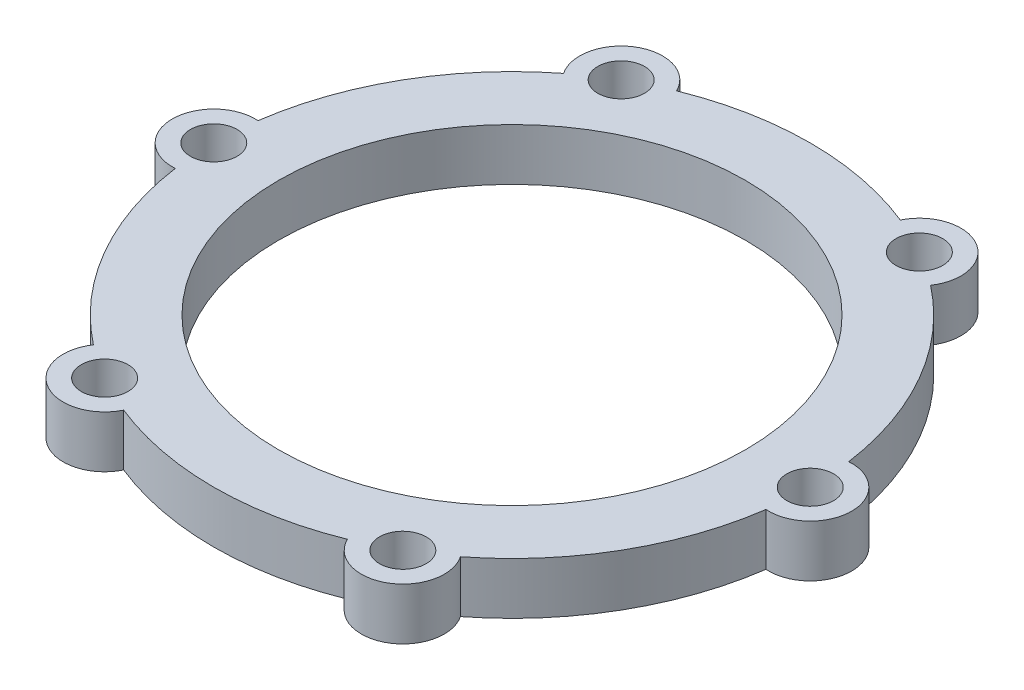
ISO-10303-21;
HEADER;
FILE_DESCRIPTION(('STEP AP214'),'2;1');
FILE_NAME('part.step','',(''),(''),'','','');
FILE_SCHEMA(('AUTOMOTIVE_DESIGN { 1 0 10303 214 1 1 1 1 }'));
ENDSEC;
DATA;
#1=APPLICATION_CONTEXT('core data for automotive mechanical design processes');
#2=APPLICATION_PROTOCOL_DEFINITION('international standard','automotive_design',2000,#1);
#3=PRODUCT_CONTEXT('',#1,'mechanical');
#4=PRODUCT('Part','Part','',(#3));
#5=PRODUCT_RELATED_PRODUCT_CATEGORY('part','',(#4));
#6=PRODUCT_DEFINITION_FORMATION('','',#4);
#7=PRODUCT_DEFINITION_CONTEXT('part definition',#1,'design');
#8=PRODUCT_DEFINITION('design','',#6,#7);
#9=PRODUCT_DEFINITION_SHAPE('','',#8);
#10=(LENGTH_UNIT() NAMED_UNIT(*) SI_UNIT(.MILLI.,.METRE.));
#11=(NAMED_UNIT(*) PLANE_ANGLE_UNIT() SI_UNIT($,.RADIAN.));
#12=(NAMED_UNIT(*) SI_UNIT($,.STERADIAN.) SOLID_ANGLE_UNIT());
#13=UNCERTAINTY_MEASURE_WITH_UNIT(LENGTH_MEASURE(1.E-05),#10,'distance_accuracy_value','');
#14=(GEOMETRIC_REPRESENTATION_CONTEXT(3) GLOBAL_UNCERTAINTY_ASSIGNED_CONTEXT((#13)) GLOBAL_UNIT_ASSIGNED_CONTEXT((#10,
#11,#12)) REPRESENTATION_CONTEXT('',''));
#15=CARTESIAN_POINT('',(0.,0.,0.));
#16=DIRECTION('',(0.,0.,1.));
#17=DIRECTION('',(1.,0.,0.));
#18=AXIS2_PLACEMENT_3D('',#15,#16,#17);
#19=CARTESIAN_POINT('',(0.,10.,0.));
#20=DIRECTION('',(0.,-1.,0.));
#21=DIRECTION('',(0.,0.,-1.));
#22=AXIS2_PLACEMENT_3D('',#19,#20,#21);
#23=CYLINDRICAL_SURFACE('',#22,57.5);
#24=CARTESIAN_POINT('',(0.,0.,0.));
#25=DIRECTION('',(0.,1.,0.));
#26=DIRECTION('',(0.,0.,1.));
#27=AXIS2_PLACEMENT_3D('',#24,#25,#26);
#28=CIRCLE('',#27,57.5);
#29=CARTESIAN_POINT('',(35.3831581356323,0.,45.3241891306269));
#30=VERTEX_POINT('',#29);
#31=CARTESIAN_POINT('',(56.9434782608696,0.,7.98061924626622));
#32=VERTEX_POINT('',#31);
#33=EDGE_CURVE('E200',#30,#32,#28,.T.);
#34=ORIENTED_EDGE('',*,*,#33,.T.);
#35=DIRECTION('',(0.,-1.,0.));
#36=VECTOR('',#35,1.);
#37=CARTESIAN_POINT('',(56.9434782608696,10.,7.98061924626622));
#38=LINE('',#37,#36);
#39=CARTESIAN_POINT('',(56.9434782608696,10.,7.98061924626622));
#40=VERTEX_POINT('',#39);
#41=EDGE_CURVE('E11',#40,#32,#38,.T.);
#42=ORIENTED_EDGE('',*,*,#41,.F.);
#43=CARTESIAN_POINT('',(0.,10.,0.));
#44=DIRECTION('',(0.,1.,0.));
#45=DIRECTION('',(0.,0.,1.));
#46=AXIS2_PLACEMENT_3D('',#43,#44,#45);
#47=CIRCLE('',#46,57.5);
#48=CARTESIAN_POINT('',(35.3831581356323,10.,45.3241891306269));
#49=VERTEX_POINT('',#48);
#50=EDGE_CURVE('E342',#49,#40,#47,.T.);
#51=ORIENTED_EDGE('',*,*,#50,.F.);
#52=DIRECTION('',(0.,-1.,0.));
#53=VECTOR('',#52,1.);
#54=CARTESIAN_POINT('',(35.3831581356323,10.,45.3241891306269));
#55=LINE('',#54,#53);
#56=EDGE_CURVE('E195',#49,#30,#55,.T.);
#57=ORIENTED_EDGE('',*,*,#56,.T.);
#58=EDGE_LOOP('',(#34,#42,#51,#57));
#59=FACE_BOUND('',#58,.T.);
#60=ADVANCED_FACE('F45',(#59),#23,.T.);
#61=CARTESIAN_POINT('',(57.5,10.,0.));
#62=DIRECTION('',(0.,-1.,0.));
#63=DIRECTION('',(0.,0.,-1.));
#64=AXIS2_PLACEMENT_3D('',#61,#62,#63);
#65=CYLINDRICAL_SURFACE('',#64,8.);
#66=CARTESIAN_POINT('',(57.5,0.,0.));
#67=DIRECTION('',(0.,1.,0.));
#68=DIRECTION('',(0.,0.,1.));
#69=AXIS2_PLACEMENT_3D('',#66,#67,#68);
#70=CIRCLE('',#69,8.);
#71=CARTESIAN_POINT('',(56.9434782608696,0.,-7.98061924626627));
#72=VERTEX_POINT('',#71);
#73=EDGE_CURVE('E204',#32,#72,#70,.T.);
#74=ORIENTED_EDGE('',*,*,#73,.T.);
#75=DIRECTION('',(0.,-1.,0.));
#76=VECTOR('',#75,1.);
#77=CARTESIAN_POINT('',(56.9434782608696,10.,-7.98061924626627));
#78=LINE('',#77,#76);
#79=CARTESIAN_POINT('',(56.9434782608696,10.,-7.98061924626627));
#80=VERTEX_POINT('',#79);
#81=EDGE_CURVE('E55',#80,#72,#78,.T.);
#82=ORIENTED_EDGE('',*,*,#81,.F.);
#83=CARTESIAN_POINT('',(57.5,10.,0.));
#84=DIRECTION('',(0.,1.,0.));
#85=DIRECTION('',(0.,0.,1.));
#86=AXIS2_PLACEMENT_3D('',#83,#84,#85);
#87=CIRCLE('',#86,8.);
#88=EDGE_CURVE('E118',#40,#80,#87,.T.);
#89=ORIENTED_EDGE('',*,*,#88,.F.);
#90=ORIENTED_EDGE('',*,*,#41,.T.);
#91=EDGE_LOOP('',(#74,#82,#89,#90));
#92=FACE_BOUND('',#91,.T.);
#93=ADVANCED_FACE('F358',(#92),#65,.T.);
#94=CARTESIAN_POINT('',(0.,10.,0.));
#95=DIRECTION('',(0.,-1.,0.));
#96=DIRECTION('',(0.,0.,-1.));
#97=AXIS2_PLACEMENT_3D('',#94,#95,#96);
#98=CYLINDRICAL_SURFACE('',#97,57.5);
#99=CARTESIAN_POINT('',(0.,0.,0.));
#100=DIRECTION('',(0.,1.,0.));
#101=DIRECTION('',(0.,0.,1.));
#102=AXIS2_PLACEMENT_3D('',#99,#100,#101);
#103=CIRCLE('',#102,57.5);
#104=CARTESIAN_POINT('',(35.3831581356323,0.,-45.3241891306269));
#105=VERTEX_POINT('',#104);
#106=EDGE_CURVE('E207',#72,#105,#103,.T.);
#107=ORIENTED_EDGE('',*,*,#106,.T.);
#108=DIRECTION('',(0.,-1.,0.));
#109=VECTOR('',#108,1.);
#110=CARTESIAN_POINT('',(35.3831581356323,10.,-45.3241891306269));
#111=LINE('',#110,#109);
#112=CARTESIAN_POINT('',(35.3831581356323,10.,-45.3241891306269));
#113=VERTEX_POINT('',#112);
#114=EDGE_CURVE('E285',#113,#105,#111,.T.);
#115=ORIENTED_EDGE('',*,*,#114,.F.);
#116=CARTESIAN_POINT('',(0.,10.,0.));
#117=DIRECTION('',(0.,1.,0.));
#118=DIRECTION('',(0.,0.,1.));
#119=AXIS2_PLACEMENT_3D('',#116,#117,#118);
#120=CIRCLE('',#119,57.5);
#121=EDGE_CURVE('E295',#80,#113,#120,.T.);
#122=ORIENTED_EDGE('',*,*,#121,.F.);
#123=ORIENTED_EDGE('',*,*,#81,.T.);
#124=EDGE_LOOP('',(#107,#115,#122,#123));
#125=FACE_BOUND('',#124,.T.);
#126=ADVANCED_FACE('F293',(#125),#98,.T.);
#127=CARTESIAN_POINT('',(28.7499999999999,10.,-49.7964607176053));
#128=DIRECTION('',(0.,-1.,0.));
#129=DIRECTION('',(0.,0.,-1.));
#130=AXIS2_PLACEMENT_3D('',#127,#128,#129);
#131=CYLINDRICAL_SURFACE('',#130,8.);
#132=CARTESIAN_POINT('',(28.7499999999999,0.,-49.7964607176053));
#133=DIRECTION('',(0.,1.,0.));
#134=DIRECTION('',(0.,0.,1.));
#135=AXIS2_PLACEMENT_3D('',#132,#133,#134);
#136=CIRCLE('',#135,8.);
#137=CARTESIAN_POINT('',(21.5603201252371,0.,-53.3048083768931));
#138=VERTEX_POINT('',#137);
#139=EDGE_CURVE('E210',#105,#138,#136,.T.);
#140=ORIENTED_EDGE('',*,*,#139,.T.);
#141=DIRECTION('',(0.,-1.,0.));
#142=VECTOR('',#141,1.);
#143=CARTESIAN_POINT('',(21.5603201252371,10.,-53.3048083768931));
#144=LINE('',#143,#142);
#145=CARTESIAN_POINT('',(21.5603201252371,10.,-53.3048083768931));
#146=VERTEX_POINT('',#145);
#147=EDGE_CURVE('E281',#146,#138,#144,.T.);
#148=ORIENTED_EDGE('',*,*,#147,.F.);
#149=CARTESIAN_POINT('',(28.7499999999999,10.,-49.7964607176053));
#150=DIRECTION('',(0.,1.,0.));
#151=DIRECTION('',(0.,0.,1.));
#152=AXIS2_PLACEMENT_3D('',#149,#150,#151);
#153=CIRCLE('',#152,8.);
#154=EDGE_CURVE('E315',#113,#146,#153,.T.);
#155=ORIENTED_EDGE('',*,*,#154,.F.);
#156=ORIENTED_EDGE('',*,*,#114,.T.);
#157=EDGE_LOOP('',(#140,#148,#155,#156));
#158=FACE_BOUND('',#157,.T.);
#159=ADVANCED_FACE('F305',(#158),#131,.T.);
#160=CARTESIAN_POINT('',(0.,10.,0.));
#161=DIRECTION('',(0.,-1.,0.));
#162=DIRECTION('',(0.,0.,-1.));
#163=AXIS2_PLACEMENT_3D('',#160,#161,#162);
#164=CYLINDRICAL_SURFACE('',#163,57.5);
#165=CARTESIAN_POINT('',(0.,0.,0.));
#166=DIRECTION('',(0.,1.,0.));
#167=DIRECTION('',(0.,0.,1.));
#168=AXIS2_PLACEMENT_3D('',#165,#166,#167);
#169=CIRCLE('',#168,57.5);
#170=CARTESIAN_POINT('',(-21.5603201252367,0.,-53.3048083768933));
#171=VERTEX_POINT('',#170);
#172=EDGE_CURVE('E213',#138,#171,#169,.T.);
#173=ORIENTED_EDGE('',*,*,#172,.T.);
#174=DIRECTION('',(0.,-1.,0.));
#175=VECTOR('',#174,1.);
#176=CARTESIAN_POINT('',(-21.5603201252367,10.,-53.3048083768933));
#177=LINE('',#176,#175);
#178=CARTESIAN_POINT('',(-21.5603201252367,10.,-53.3048083768933));
#179=VERTEX_POINT('',#178);
#180=EDGE_CURVE('E277',#179,#171,#177,.T.);
#181=ORIENTED_EDGE('',*,*,#180,.F.);
#182=CARTESIAN_POINT('',(0.,10.,0.));
#183=DIRECTION('',(0.,1.,0.));
#184=DIRECTION('',(0.,0.,1.));
#185=AXIS2_PLACEMENT_3D('',#182,#183,#184);
#186=CIRCLE('',#185,57.5);
#187=EDGE_CURVE('E311',#146,#179,#186,.T.);
#188=ORIENTED_EDGE('',*,*,#187,.F.);
#189=ORIENTED_EDGE('',*,*,#147,.T.);
#190=EDGE_LOOP('',(#173,#181,#188,#189));
#191=FACE_BOUND('',#190,.T.);
#192=ADVANCED_FACE('F309',(#191),#164,.T.);
#193=CARTESIAN_POINT('',(-28.7499999999996,10.,-49.7964607176055));
#194=DIRECTION('',(0.,-1.,0.));
#195=DIRECTION('',(0.,0.,-1.));
#196=AXIS2_PLACEMENT_3D('',#193,#194,#195);
#197=CYLINDRICAL_SURFACE('',#196,8.);
#198=CARTESIAN_POINT('',(-28.7499999999996,0.,-49.7964607176055));
#199=DIRECTION('',(0.,1.,0.));
#200=DIRECTION('',(0.,0.,1.));
#201=AXIS2_PLACEMENT_3D('',#198,#199,#200);
#202=CIRCLE('',#201,8.);
#203=CARTESIAN_POINT('',(-35.383158135632,0.,-45.3241891306272));
#204=VERTEX_POINT('',#203);
#205=EDGE_CURVE('E216',#171,#204,#202,.T.);
#206=ORIENTED_EDGE('',*,*,#205,.T.);
#207=DIRECTION('',(0.,-1.,0.));
#208=VECTOR('',#207,1.);
#209=CARTESIAN_POINT('',(-35.383158135632,10.,-45.3241891306272));
#210=LINE('',#209,#208);
#211=CARTESIAN_POINT('',(-35.383158135632,10.,-45.3241891306272));
#212=VERTEX_POINT('',#211);
#213=EDGE_CURVE('E273',#212,#204,#210,.T.);
#214=ORIENTED_EDGE('',*,*,#213,.F.);
#215=CARTESIAN_POINT('',(-28.7499999999996,10.,-49.7964607176055));
#216=DIRECTION('',(0.,1.,0.));
#217=DIRECTION('',(0.,0.,1.));
#218=AXIS2_PLACEMENT_3D('',#215,#216,#217);
#219=CIRCLE('',#218,8.);
#220=EDGE_CURVE('E314',#179,#212,#219,.T.);
#221=ORIENTED_EDGE('',*,*,#220,.F.);
#222=ORIENTED_EDGE('',*,*,#180,.T.);
#223=EDGE_LOOP('',(#206,#214,#221,#222));
#224=FACE_BOUND('',#223,.T.);
#225=ADVANCED_FACE('F370',(#224),#197,.T.);
#226=CARTESIAN_POINT('',(0.,10.,0.));
#227=DIRECTION('',(0.,-1.,0.));
#228=DIRECTION('',(0.,0.,-1.));
#229=AXIS2_PLACEMENT_3D('',#226,#227,#228);
#230=CYLINDRICAL_SURFACE('',#229,57.5);
#231=CARTESIAN_POINT('',(0.,0.,0.));
#232=DIRECTION('',(0.,1.,0.));
#233=DIRECTION('',(0.,0.,1.));
#234=AXIS2_PLACEMENT_3D('',#231,#232,#233);
#235=CIRCLE('',#234,57.5);
#236=CARTESIAN_POINT('',(-56.9434782608695,0.,-7.98061924626663));
#237=VERTEX_POINT('',#236);
#238=EDGE_CURVE('E219',#204,#237,#235,.T.);
#239=ORIENTED_EDGE('',*,*,#238,.T.);
#240=DIRECTION('',(0.,-1.,0.));
#241=VECTOR('',#240,1.);
#242=CARTESIAN_POINT('',(-56.9434782608695,10.,-7.98061924626663));
#243=LINE('',#242,#241);
#244=CARTESIAN_POINT('',(-56.9434782608695,10.,-7.98061924626663));
#245=VERTEX_POINT('',#244);
#246=EDGE_CURVE('E269',#245,#237,#243,.T.);
#247=ORIENTED_EDGE('',*,*,#246,.F.);
#248=CARTESIAN_POINT('',(0.,10.,0.));
#249=DIRECTION('',(0.,1.,0.));
#250=DIRECTION('',(0.,0.,1.));
#251=AXIS2_PLACEMENT_3D('',#248,#249,#250);
#252=CIRCLE('',#251,57.5);
#253=EDGE_CURVE('E319',#212,#245,#252,.T.);
#254=ORIENTED_EDGE('',*,*,#253,.F.);
#255=ORIENTED_EDGE('',*,*,#213,.T.);
#256=EDGE_LOOP('',(#239,#247,#254,#255));
#257=FACE_BOUND('',#256,.T.);
#258=ADVANCED_FACE('F373',(#257),#230,.T.);
#259=CARTESIAN_POINT('',(-57.5,10.,-3.92047505570758E-13));
#260=DIRECTION('',(0.,-1.,0.));
#261=DIRECTION('',(0.,0.,-1.));
#262=AXIS2_PLACEMENT_3D('',#259,#260,#261);
#263=CYLINDRICAL_SURFACE('',#262,8.);
#264=CARTESIAN_POINT('',(-57.5,0.,-3.92047505570758E-13));
#265=DIRECTION('',(0.,1.,0.));
#266=DIRECTION('',(0.,0.,1.));
#267=AXIS2_PLACEMENT_3D('',#264,#265,#266);
#268=CIRCLE('',#267,8.);
#269=CARTESIAN_POINT('',(-56.9434782608696,0.,7.98061924626585));
#270=VERTEX_POINT('',#269);
#271=EDGE_CURVE('E222',#237,#270,#268,.T.);
#272=ORIENTED_EDGE('',*,*,#271,.T.);
#273=DIRECTION('',(0.,-1.,0.));
#274=VECTOR('',#273,1.);
#275=CARTESIAN_POINT('',(-56.9434782608696,10.,7.98061924626585));
#276=LINE('',#275,#274);
#277=CARTESIAN_POINT('',(-56.9434782608696,10.,7.98061924626585));
#278=VERTEX_POINT('',#277);
#279=EDGE_CURVE('E265',#278,#270,#276,.T.);
#280=ORIENTED_EDGE('',*,*,#279,.F.);
#281=CARTESIAN_POINT('',(-57.5,10.,-3.92047505570758E-13));
#282=DIRECTION('',(0.,1.,0.));
#283=DIRECTION('',(0.,0.,1.));
#284=AXIS2_PLACEMENT_3D('',#281,#282,#283);
#285=CIRCLE('',#284,8.);
#286=EDGE_CURVE('E326',#245,#278,#285,.T.);
#287=ORIENTED_EDGE('',*,*,#286,.F.);
#288=ORIENTED_EDGE('',*,*,#246,.T.);
#289=EDGE_LOOP('',(#272,#280,#287,#288));
#290=FACE_BOUND('',#289,.T.);
#291=ADVANCED_FACE('F334',(#290),#263,.T.);
#292=CARTESIAN_POINT('',(0.,10.,0.));
#293=DIRECTION('',(0.,-1.,0.));
#294=DIRECTION('',(0.,0.,-1.));
#295=AXIS2_PLACEMENT_3D('',#292,#293,#294);
#296=CYLINDRICAL_SURFACE('',#295,57.5);
#297=CARTESIAN_POINT('',(0.,0.,0.));
#298=DIRECTION('',(0.,1.,0.));
#299=DIRECTION('',(0.,0.,1.));
#300=AXIS2_PLACEMENT_3D('',#297,#298,#299);
#301=CIRCLE('',#300,57.5);
#302=CARTESIAN_POINT('',(-35.3831581356326,0.,45.3241891306267));
#303=VERTEX_POINT('',#302);
#304=EDGE_CURVE('E225',#270,#303,#301,.T.);
#305=ORIENTED_EDGE('',*,*,#304,.T.);
#306=DIRECTION('',(0.,-1.,0.));
#307=VECTOR('',#306,1.);
#308=CARTESIAN_POINT('',(-35.3831581356326,10.,45.3241891306267));
#309=LINE('',#308,#307);
#310=CARTESIAN_POINT('',(-35.3831581356326,10.,45.3241891306267));
#311=VERTEX_POINT('',#310);
#312=EDGE_CURVE('E161',#311,#303,#309,.T.);
#313=ORIENTED_EDGE('',*,*,#312,.F.);
#314=CARTESIAN_POINT('',(0.,10.,0.));
#315=DIRECTION('',(0.,1.,0.));
#316=DIRECTION('',(0.,0.,1.));
#317=AXIS2_PLACEMENT_3D('',#314,#315,#316);
#318=CIRCLE('',#317,57.5);
#319=EDGE_CURVE('E150',#278,#311,#318,.T.);
#320=ORIENTED_EDGE('',*,*,#319,.F.);
#321=ORIENTED_EDGE('',*,*,#279,.T.);
#322=EDGE_LOOP('',(#305,#313,#320,#321));
#323=FACE_BOUND('',#322,.T.);
#324=ADVANCED_FACE('F338',(#323),#296,.T.);
#325=CARTESIAN_POINT('',(-28.7500000000002,10.,49.7964607176051));
#326=DIRECTION('',(0.,-1.,0.));
#327=DIRECTION('',(0.,0.,-1.));
#328=AXIS2_PLACEMENT_3D('',#325,#326,#327);
#329=CYLINDRICAL_SURFACE('',#328,7.99999999999999);
#330=CARTESIAN_POINT('',(-28.7500000000002,0.,49.7964607176051));
#331=DIRECTION('',(0.,1.,0.));
#332=DIRECTION('',(0.,0.,1.));
#333=AXIS2_PLACEMENT_3D('',#330,#331,#332);
#334=CIRCLE('',#333,7.99999999999999);
#335=CARTESIAN_POINT('',(-21.5603201252374,0.,53.304808376893));
#336=VERTEX_POINT('',#335);
#337=EDGE_CURVE('E159',#303,#336,#334,.T.);
#338=ORIENTED_EDGE('',*,*,#337,.T.);
#339=DIRECTION('',(0.,-1.,0.));
#340=VECTOR('',#339,1.);
#341=CARTESIAN_POINT('',(-21.5603201252374,10.,53.304808376893));
#342=LINE('',#341,#340);
#343=CARTESIAN_POINT('',(-21.5603201252374,10.,53.304808376893));
#344=VERTEX_POINT('',#343);
#345=EDGE_CURVE('E156',#344,#336,#342,.T.);
#346=ORIENTED_EDGE('',*,*,#345,.F.);
#347=CARTESIAN_POINT('',(-28.7500000000002,10.,49.7964607176051));
#348=DIRECTION('',(0.,1.,0.));
#349=DIRECTION('',(0.,0.,1.));
#350=AXIS2_PLACEMENT_3D('',#347,#348,#349);
#351=CIRCLE('',#350,7.99999999999999);
#352=EDGE_CURVE('E143',#311,#344,#351,.T.);
#353=ORIENTED_EDGE('',*,*,#352,.F.);
#354=ORIENTED_EDGE('',*,*,#312,.T.);
#355=EDGE_LOOP('',(#338,#346,#353,#354));
#356=FACE_BOUND('',#355,.T.);
#357=ADVANCED_FACE('F157',(#356),#329,.T.);
#358=CARTESIAN_POINT('',(0.,10.,0.));
#359=DIRECTION('',(0.,-1.,0.));
#360=DIRECTION('',(0.,0.,-1.));
#361=AXIS2_PLACEMENT_3D('',#358,#359,#360);
#362=CYLINDRICAL_SURFACE('',#361,57.5);
#363=CARTESIAN_POINT('',(0.,0.,0.));
#364=DIRECTION('',(0.,1.,0.));
#365=DIRECTION('',(0.,0.,1.));
#366=AXIS2_PLACEMENT_3D('',#363,#364,#365);
#367=CIRCLE('',#366,57.5);
#368=CARTESIAN_POINT('',(21.5603201252371,0.,53.3048083768931));
#369=VERTEX_POINT('',#368);
#370=EDGE_CURVE('E104',#336,#369,#367,.T.);
#371=ORIENTED_EDGE('',*,*,#370,.T.);
#372=DIRECTION('',(0.,-1.,0.));
#373=VECTOR('',#372,1.);
#374=CARTESIAN_POINT('',(21.5603201252371,10.,53.3048083768931));
#375=LINE('',#374,#373);
#376=CARTESIAN_POINT('',(21.5603201252371,10.,53.3048083768931));
#377=VERTEX_POINT('',#376);
#378=EDGE_CURVE('E162',#377,#369,#375,.T.);
#379=ORIENTED_EDGE('',*,*,#378,.F.);
#380=CARTESIAN_POINT('',(0.,10.,0.));
#381=DIRECTION('',(0.,1.,0.));
#382=DIRECTION('',(0.,0.,1.));
#383=AXIS2_PLACEMENT_3D('',#380,#381,#382);
#384=CIRCLE('',#383,57.5);
#385=EDGE_CURVE('E148',#344,#377,#384,.T.);
#386=ORIENTED_EDGE('',*,*,#385,.F.);
#387=ORIENTED_EDGE('',*,*,#345,.T.);
#388=EDGE_LOOP('',(#371,#379,#386,#387));
#389=FACE_BOUND('',#388,.T.);
#390=ADVANCED_FACE('F164',(#389),#362,.T.);
#391=CARTESIAN_POINT('',(28.7499999999999,10.,-49.7964607176053));
#392=DIRECTION('',(0.,-1.,0.));
#393=DIRECTION('',(0.,0.,-1.));
#394=AXIS2_PLACEMENT_3D('',#391,#392,#393);
#395=CYLINDRICAL_SURFACE('',#394,4.5);
#396=CARTESIAN_POINT('',(28.7499999999999,10.,-49.7964607176053));
#397=DIRECTION('',(0.,1.,0.));
#398=DIRECTION('',(0.,0.,1.));
#399=AXIS2_PLACEMENT_3D('',#396,#397,#398);
#400=CIRCLE('',#399,4.5);
#401=CARTESIAN_POINT('',(28.7499999999999,10.,-45.2964607176053));
#402=VERTEX_POINT('',#401);
#403=EDGE_CURVE('E187',#402,#402,#400,.T.);
#404=ORIENTED_EDGE('',*,*,#403,.T.);
#405=EDGE_LOOP('',(#404));
#406=FACE_BOUND('',#405,.T.);
#407=CARTESIAN_POINT('',(28.7499999999999,0.,-49.7964607176053));
#408=DIRECTION('',(0.,1.,0.));
#409=DIRECTION('',(0.,0.,1.));
#410=AXIS2_PLACEMENT_3D('',#407,#408,#409);
#411=CIRCLE('',#410,4.5);
#412=CARTESIAN_POINT('',(28.7499999999999,0.,-45.2964607176053));
#413=VERTEX_POINT('',#412);
#414=EDGE_CURVE('E250',#413,#413,#411,.T.);
#415=ORIENTED_EDGE('',*,*,#414,.F.);
#416=EDGE_LOOP('',(#415));
#417=FACE_BOUND('',#416,.T.);
#418=ADVANCED_FACE('F384',(#406,#417),#395,.F.);
#419=CARTESIAN_POINT('',(-28.7499999999996,10.,-49.7964607176055));
#420=DIRECTION('',(0.,-1.,0.));
#421=DIRECTION('',(0.,0.,-1.));
#422=AXIS2_PLACEMENT_3D('',#419,#420,#421);
#423=CYLINDRICAL_SURFACE('',#422,4.5);
#424=CARTESIAN_POINT('',(-28.7499999999996,10.,-49.7964607176055));
#425=DIRECTION('',(0.,1.,0.));
#426=DIRECTION('',(0.,0.,1.));
#427=AXIS2_PLACEMENT_3D('',#424,#425,#426);
#428=CIRCLE('',#427,4.5);
#429=CARTESIAN_POINT('',(-28.7499999999996,10.,-45.2964607176055));
#430=VERTEX_POINT('',#429);
#431=EDGE_CURVE('E183',#430,#430,#428,.T.);
#432=ORIENTED_EDGE('',*,*,#431,.T.);
#433=EDGE_LOOP('',(#432));
#434=FACE_BOUND('',#433,.T.);
#435=CARTESIAN_POINT('',(-28.7499999999996,0.,-49.7964607176055));
#436=DIRECTION('',(0.,1.,0.));
#437=DIRECTION('',(0.,0.,1.));
#438=AXIS2_PLACEMENT_3D('',#435,#436,#437);
#439=CIRCLE('',#438,4.5);
#440=CARTESIAN_POINT('',(-28.7499999999996,0.,-45.2964607176055));
#441=VERTEX_POINT('',#440);
#442=EDGE_CURVE('E246',#441,#441,#439,.T.);
#443=ORIENTED_EDGE('',*,*,#442,.F.);
#444=EDGE_LOOP('',(#443));
#445=FACE_BOUND('',#444,.T.);
#446=ADVANCED_FACE('F388',(#434,#445),#423,.F.);
#447=CARTESIAN_POINT('',(-57.5,10.,-3.92047505570758E-13));
#448=DIRECTION('',(0.,-1.,0.));
#449=DIRECTION('',(0.,0.,-1.));
#450=AXIS2_PLACEMENT_3D('',#447,#448,#449);
#451=CYLINDRICAL_SURFACE('',#450,4.49999999999999);
#452=CARTESIAN_POINT('',(-57.5,10.,-3.92047505570758E-13));
#453=DIRECTION('',(0.,1.,0.));
#454=DIRECTION('',(0.,0.,1.));
#455=AXIS2_PLACEMENT_3D('',#452,#453,#454);
#456=CIRCLE('',#455,4.49999999999999);
#457=CARTESIAN_POINT('',(-57.5,10.,4.4999999999996));
#458=VERTEX_POINT('',#457);
#459=EDGE_CURVE('E179',#458,#458,#456,.T.);
#460=ORIENTED_EDGE('',*,*,#459,.T.);
#461=EDGE_LOOP('',(#460));
#462=FACE_BOUND('',#461,.T.);
#463=CARTESIAN_POINT('',(-57.5,0.,-3.92047505570758E-13));
#464=DIRECTION('',(0.,1.,0.));
#465=DIRECTION('',(0.,0.,1.));
#466=AXIS2_PLACEMENT_3D('',#463,#464,#465);
#467=CIRCLE('',#466,4.49999999999999);
#468=CARTESIAN_POINT('',(-57.5,0.,4.4999999999996));
#469=VERTEX_POINT('',#468);
#470=EDGE_CURVE('E242',#469,#469,#467,.T.);
#471=ORIENTED_EDGE('',*,*,#470,.F.);
#472=EDGE_LOOP('',(#471));
#473=FACE_BOUND('',#472,.T.);
#474=ADVANCED_FACE('F394',(#462,#473),#451,.F.);
#475=CARTESIAN_POINT('',(-28.7500000000002,10.,49.7964607176051));
#476=DIRECTION('',(0.,-1.,0.));
#477=DIRECTION('',(0.,0.,-1.));
#478=AXIS2_PLACEMENT_3D('',#475,#476,#477);
#479=CYLINDRICAL_SURFACE('',#478,4.5);
#480=CARTESIAN_POINT('',(-28.7500000000002,10.,49.7964607176051));
#481=DIRECTION('',(0.,1.,0.));
#482=DIRECTION('',(0.,0.,1.));
#483=AXIS2_PLACEMENT_3D('',#480,#481,#482);
#484=CIRCLE('',#483,4.5);
#485=CARTESIAN_POINT('',(-28.7500000000002,10.,54.2964607176051));
#486=VERTEX_POINT('',#485);
#487=EDGE_CURVE('E175',#486,#486,#484,.T.);
#488=ORIENTED_EDGE('',*,*,#487,.T.);
#489=EDGE_LOOP('',(#488));
#490=FACE_BOUND('',#489,.T.);
#491=CARTESIAN_POINT('',(-28.7500000000002,0.,49.7964607176051));
#492=DIRECTION('',(0.,1.,0.));
#493=DIRECTION('',(0.,0.,1.));
#494=AXIS2_PLACEMENT_3D('',#491,#492,#493);
#495=CIRCLE('',#494,4.5);
#496=CARTESIAN_POINT('',(-28.7500000000002,0.,54.2964607176051));
#497=VERTEX_POINT('',#496);
#498=EDGE_CURVE('E238',#497,#497,#495,.T.);
#499=ORIENTED_EDGE('',*,*,#498,.F.);
#500=EDGE_LOOP('',(#499));
#501=FACE_BOUND('',#500,.T.);
#502=ADVANCED_FACE('F353',(#490,#501),#479,.F.);
#503=CARTESIAN_POINT('',(28.7499999999999,10.,49.7964607176053));
#504=DIRECTION('',(0.,-1.,0.));
#505=DIRECTION('',(0.,0.,-1.));
#506=AXIS2_PLACEMENT_3D('',#503,#504,#505);
#507=CYLINDRICAL_SURFACE('',#506,4.5);
#508=CARTESIAN_POINT('',(28.7499999999999,10.,49.7964607176053));
#509=DIRECTION('',(0.,1.,0.));
#510=DIRECTION('',(0.,0.,1.));
#511=AXIS2_PLACEMENT_3D('',#508,#509,#510);
#512=CIRCLE('',#511,4.5);
#513=CARTESIAN_POINT('',(28.7499999999999,10.,54.2964607176053));
#514=VERTEX_POINT('',#513);
#515=EDGE_CURVE('E168',#514,#514,#512,.T.);
#516=ORIENTED_EDGE('',*,*,#515,.T.);
#517=EDGE_LOOP('',(#516));
#518=FACE_BOUND('',#517,.T.);
#519=CARTESIAN_POINT('',(28.7499999999999,0.,49.7964607176053));
#520=DIRECTION('',(0.,1.,0.));
#521=DIRECTION('',(0.,0.,1.));
#522=AXIS2_PLACEMENT_3D('',#519,#520,#521);
#523=CIRCLE('',#522,4.5);
#524=CARTESIAN_POINT('',(28.7499999999999,0.,54.2964607176053));
#525=VERTEX_POINT('',#524);
#526=EDGE_CURVE('E234',#525,#525,#523,.T.);
#527=ORIENTED_EDGE('',*,*,#526,.F.);
#528=EDGE_LOOP('',(#527));
#529=FACE_BOUND('',#528,.T.);
#530=ADVANCED_FACE('F345',(#518,#529),#507,.F.);
#531=CARTESIAN_POINT('',(28.7499999999999,10.,49.7964607176053));
#532=DIRECTION('',(0.,-1.,0.));
#533=DIRECTION('',(0.,0.,-1.));
#534=AXIS2_PLACEMENT_3D('',#531,#532,#533);
#535=CYLINDRICAL_SURFACE('',#534,8.);
#536=CARTESIAN_POINT('',(28.7499999999999,0.,49.7964607176053));
#537=DIRECTION('',(0.,1.,0.));
#538=DIRECTION('',(0.,0.,1.));
#539=AXIS2_PLACEMENT_3D('',#536,#537,#538);
#540=CIRCLE('',#539,8.);
#541=EDGE_CURVE('E110',#369,#30,#540,.T.);
#542=ORIENTED_EDGE('',*,*,#541,.T.);
#543=ORIENTED_EDGE('',*,*,#56,.F.);
#544=CARTESIAN_POINT('',(28.7499999999999,10.,49.7964607176053));
#545=DIRECTION('',(0.,1.,0.));
#546=DIRECTION('',(0.,0.,1.));
#547=AXIS2_PLACEMENT_3D('',#544,#545,#546);
#548=CIRCLE('',#547,8.);
#549=EDGE_CURVE('E63',#377,#49,#548,.T.);
#550=ORIENTED_EDGE('',*,*,#549,.F.);
#551=ORIENTED_EDGE('',*,*,#378,.T.);
#552=EDGE_LOOP('',(#542,#543,#550,#551));
#553=FACE_BOUND('',#552,.T.);
#554=ADVANCED_FACE('F343',(#553),#535,.T.);
#555=CARTESIAN_POINT('',(0.,10.,0.));
#556=DIRECTION('',(0.,-1.,0.));
#557=DIRECTION('',(0.,0.,-1.));
#558=AXIS2_PLACEMENT_3D('',#555,#556,#557);
#559=CYLINDRICAL_SURFACE('',#558,45.);
#560=CARTESIAN_POINT('',(0.,10.,0.));
#561=DIRECTION('',(0.,1.,0.));
#562=DIRECTION('',(0.,0.,1.));
#563=AXIS2_PLACEMENT_3D('',#560,#561,#562);
#564=CIRCLE('',#563,45.);
#565=CARTESIAN_POINT('',(0.,10.,45.));
#566=VERTEX_POINT('',#565);
#567=EDGE_CURVE('E258',#566,#566,#564,.T.);
#568=ORIENTED_EDGE('',*,*,#567,.T.);
#569=EDGE_LOOP('',(#568));
#570=FACE_BOUND('',#569,.T.);
#571=CARTESIAN_POINT('',(0.,0.,0.));
#572=DIRECTION('',(0.,1.,0.));
#573=DIRECTION('',(0.,0.,1.));
#574=AXIS2_PLACEMENT_3D('',#571,#572,#573);
#575=CIRCLE('',#574,45.);
#576=CARTESIAN_POINT('',(0.,0.,45.));
#577=VERTEX_POINT('',#576);
#578=EDGE_CURVE('E196',#577,#577,#575,.T.);
#579=ORIENTED_EDGE('',*,*,#578,.F.);
#580=EDGE_LOOP('',(#579));
#581=FACE_BOUND('',#580,.T.);
#582=ADVANCED_FACE('F47',(#570,#581),#559,.F.);
#583=CARTESIAN_POINT('',(57.5,10.,0.));
#584=DIRECTION('',(0.,-1.,0.));
#585=DIRECTION('',(0.,0.,-1.));
#586=AXIS2_PLACEMENT_3D('',#583,#584,#585);
#587=CYLINDRICAL_SURFACE('',#586,4.49999999999999);
#588=CARTESIAN_POINT('',(57.5,10.,0.));
#589=DIRECTION('',(0.,1.,0.));
#590=DIRECTION('',(0.,0.,1.));
#591=AXIS2_PLACEMENT_3D('',#588,#589,#590);
#592=CIRCLE('',#591,4.49999999999999);
#593=CARTESIAN_POINT('',(57.5,10.,4.49999999999996));
#594=VERTEX_POINT('',#593);
#595=EDGE_CURVE('E191',#594,#594,#592,.T.);
#596=ORIENTED_EDGE('',*,*,#595,.T.);
#597=EDGE_LOOP('',(#596));
#598=FACE_BOUND('',#597,.T.);
#599=CARTESIAN_POINT('',(57.5,0.,0.));
#600=DIRECTION('',(0.,1.,0.));
#601=DIRECTION('',(0.,0.,1.));
#602=AXIS2_PLACEMENT_3D('',#599,#600,#601);
#603=CIRCLE('',#602,4.49999999999999);
#604=CARTESIAN_POINT('',(57.5,0.,4.49999999999996));
#605=VERTEX_POINT('',#604);
#606=EDGE_CURVE('E254',#605,#605,#603,.T.);
#607=ORIENTED_EDGE('',*,*,#606,.F.);
#608=EDGE_LOOP('',(#607));
#609=FACE_BOUND('',#608,.T.);
#610=ADVANCED_FACE('F351',(#598,#609),#587,.F.);
#611=CARTESIAN_POINT('',(0.,10.,0.));
#612=DIRECTION('',(0.,1.,0.));
#613=DIRECTION('',(0.,0.,1.));
#614=AXIS2_PLACEMENT_3D('',#611,#612,#613);
#615=PLANE('',#614);
#616=ORIENTED_EDGE('',*,*,#567,.F.);
#617=EDGE_LOOP('',(#616));
#618=FACE_BOUND('',#617,.T.);
#619=ORIENTED_EDGE('',*,*,#50,.T.);
#620=ORIENTED_EDGE('',*,*,#88,.T.);
#621=ORIENTED_EDGE('',*,*,#121,.T.);
#622=ORIENTED_EDGE('',*,*,#154,.T.);
#623=ORIENTED_EDGE('',*,*,#187,.T.);
#624=ORIENTED_EDGE('',*,*,#220,.T.);
#625=ORIENTED_EDGE('',*,*,#253,.T.);
#626=ORIENTED_EDGE('',*,*,#286,.T.);
#627=ORIENTED_EDGE('',*,*,#319,.T.);
#628=ORIENTED_EDGE('',*,*,#352,.T.);
#629=ORIENTED_EDGE('',*,*,#385,.T.);
#630=ORIENTED_EDGE('',*,*,#549,.T.);
#631=EDGE_LOOP('',(#619,#620,#621,#622,#623,#624,#625,#626,#627,#628,#629,#630));
#632=FACE_BOUND('',#631,.T.);
#633=ORIENTED_EDGE('',*,*,#515,.F.);
#634=EDGE_LOOP('',(#633));
#635=FACE_BOUND('',#634,.T.);
#636=ORIENTED_EDGE('',*,*,#487,.F.);
#637=EDGE_LOOP('',(#636));
#638=FACE_BOUND('',#637,.T.);
#639=ORIENTED_EDGE('',*,*,#459,.F.);
#640=EDGE_LOOP('',(#639));
#641=FACE_BOUND('',#640,.T.);
#642=ORIENTED_EDGE('',*,*,#431,.F.);
#643=EDGE_LOOP('',(#642));
#644=FACE_BOUND('',#643,.T.);
#645=ORIENTED_EDGE('',*,*,#403,.F.);
#646=EDGE_LOOP('',(#645));
#647=FACE_BOUND('',#646,.T.);
#648=ORIENTED_EDGE('',*,*,#595,.F.);
#649=EDGE_LOOP('',(#648));
#650=FACE_BOUND('',#649,.T.);
#651=ADVANCED_FACE('F145',(#618,#632,#635,#638,#641,#644,#647,#650),#615,.T.);
#652=CARTESIAN_POINT('',(0.,0.,0.));
#653=DIRECTION('',(0.,1.,0.));
#654=DIRECTION('',(0.,0.,1.));
#655=AXIS2_PLACEMENT_3D('',#652,#653,#654);
#656=PLANE('',#655);
#657=ORIENTED_EDGE('',*,*,#578,.T.);
#658=EDGE_LOOP('',(#657));
#659=FACE_BOUND('',#658,.T.);
#660=ORIENTED_EDGE('',*,*,#33,.F.);
#661=ORIENTED_EDGE('',*,*,#541,.F.);
#662=ORIENTED_EDGE('',*,*,#370,.F.);
#663=ORIENTED_EDGE('',*,*,#337,.F.);
#664=ORIENTED_EDGE('',*,*,#304,.F.);
#665=ORIENTED_EDGE('',*,*,#271,.F.);
#666=ORIENTED_EDGE('',*,*,#238,.F.);
#667=ORIENTED_EDGE('',*,*,#205,.F.);
#668=ORIENTED_EDGE('',*,*,#172,.F.);
#669=ORIENTED_EDGE('',*,*,#139,.F.);
#670=ORIENTED_EDGE('',*,*,#106,.F.);
#671=ORIENTED_EDGE('',*,*,#73,.F.);
#672=EDGE_LOOP('',(#660,#661,#662,#663,#664,#665,#666,#667,#668,#669,#670,#671));
#673=FACE_BOUND('',#672,.T.);
#674=ORIENTED_EDGE('',*,*,#526,.T.);
#675=EDGE_LOOP('',(#674));
#676=FACE_BOUND('',#675,.T.);
#677=ORIENTED_EDGE('',*,*,#498,.T.);
#678=EDGE_LOOP('',(#677));
#679=FACE_BOUND('',#678,.T.);
#680=ORIENTED_EDGE('',*,*,#470,.T.);
#681=EDGE_LOOP('',(#680));
#682=FACE_BOUND('',#681,.T.);
#683=ORIENTED_EDGE('',*,*,#442,.T.);
#684=EDGE_LOOP('',(#683));
#685=FACE_BOUND('',#684,.T.);
#686=ORIENTED_EDGE('',*,*,#414,.T.);
#687=EDGE_LOOP('',(#686));
#688=FACE_BOUND('',#687,.T.);
#689=ORIENTED_EDGE('',*,*,#606,.T.);
#690=EDGE_LOOP('',(#689));
#691=FACE_BOUND('',#690,.T.);
#692=ADVANCED_FACE('F299',(#659,#673,#676,#679,#682,#685,#688,#691),#656,.F.);
#693=CLOSED_SHELL('',(#60,#93,#126,#159,#192,#225,#258,#291,#324,#357,#390,#418,#446,#474,#502,
#530,#554,#582,#610,#651,#692));
#694=MANIFOLD_SOLID_BREP('B2',#693);
#695=ADVANCED_BREP_SHAPE_REPRESENTATION('',(#18,#694),#14);
#696=SHAPE_DEFINITION_REPRESENTATION(#9,#695);
ENDSEC;
END-ISO-10303-21;
